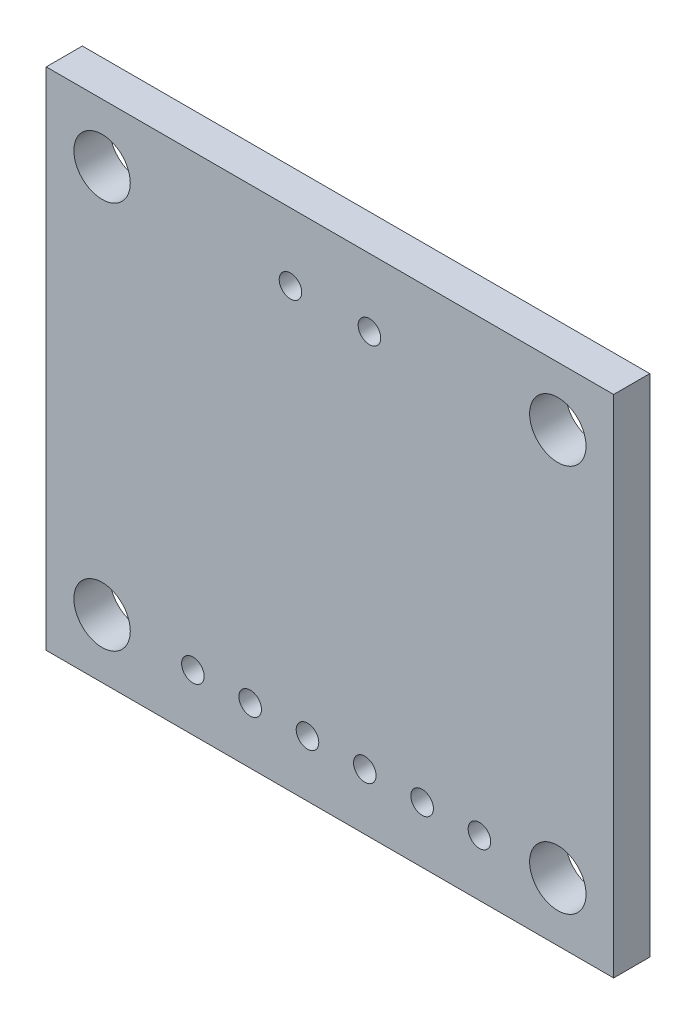
ISO-10303-21;
HEADER;
FILE_DESCRIPTION(('STEP AP214'),'2;1');
FILE_NAME('part.step','',(''),(''),'','','');
FILE_SCHEMA(('AUTOMOTIVE_DESIGN { 1 0 10303 214 1 1 1 1 }'));
ENDSEC;
DATA;
#1=APPLICATION_CONTEXT('core data for automotive mechanical design processes');
#2=APPLICATION_PROTOCOL_DEFINITION('international standard','automotive_design',2000,#1);
#3=PRODUCT_CONTEXT('',#1,'mechanical');
#4=PRODUCT('Part','Part','',(#3));
#5=PRODUCT_RELATED_PRODUCT_CATEGORY('part','',(#4));
#6=PRODUCT_DEFINITION_FORMATION('','',#4);
#7=PRODUCT_DEFINITION_CONTEXT('part definition',#1,'design');
#8=PRODUCT_DEFINITION('design','',#6,#7);
#9=PRODUCT_DEFINITION_SHAPE('','',#8);
#10=(LENGTH_UNIT() NAMED_UNIT(*) SI_UNIT(.MILLI.,.METRE.));
#11=(NAMED_UNIT(*) PLANE_ANGLE_UNIT() SI_UNIT($,.RADIAN.));
#12=(NAMED_UNIT(*) SI_UNIT($,.STERADIAN.) SOLID_ANGLE_UNIT());
#13=UNCERTAINTY_MEASURE_WITH_UNIT(LENGTH_MEASURE(1.E-05),#10,'distance_accuracy_value','');
#14=(GEOMETRIC_REPRESENTATION_CONTEXT(3) GLOBAL_UNCERTAINTY_ASSIGNED_CONTEXT((#13)) GLOBAL_UNIT_ASSIGNED_CONTEXT((#10,
#11,#12)) REPRESENTATION_CONTEXT('',''));
#15=CARTESIAN_POINT('',(0.,0.,0.));
#16=DIRECTION('',(0.,0.,1.));
#17=DIRECTION('',(1.,0.,0.));
#18=AXIS2_PLACEMENT_3D('',#15,#16,#17);
#19=CARTESIAN_POINT('',(0.,0.,1.6));
#20=DIRECTION('',(0.,0.,-1.));
#21=DIRECTION('',(-1.,0.,0.));
#22=AXIS2_PLACEMENT_3D('',#19,#20,#21);
#23=PLANE('',#22);
#24=DIRECTION('',(0.,1.,0.));
#25=VECTOR('',#24,1.);
#26=CARTESIAN_POINT('',(12.575,-11.2,1.6));
#27=LINE('',#26,#25);
#28=CARTESIAN_POINT('',(12.575,-11.2,1.6));
#29=VERTEX_POINT('',#28);
#30=CARTESIAN_POINT('',(12.575,11.2,1.6));
#31=VERTEX_POINT('',#30);
#32=EDGE_CURVE('E85',#29,#31,#27,.T.);
#33=ORIENTED_EDGE('',*,*,#32,.T.);
#34=DIRECTION('',(-1.,0.,0.));
#35=VECTOR('',#34,1.);
#36=CARTESIAN_POINT('',(-12.575,11.2,1.6));
#37=LINE('',#36,#35);
#38=CARTESIAN_POINT('',(-12.575,11.2,1.6));
#39=VERTEX_POINT('',#38);
#40=EDGE_CURVE('E80',#31,#39,#37,.T.);
#41=ORIENTED_EDGE('',*,*,#40,.T.);
#42=DIRECTION('',(0.,-1.,0.));
#43=VECTOR('',#42,1.);
#44=CARTESIAN_POINT('',(-12.575,-11.2,1.6));
#45=LINE('',#44,#43);
#46=CARTESIAN_POINT('',(-12.575,-11.2,1.6));
#47=VERTEX_POINT('',#46);
#48=EDGE_CURVE('E83',#39,#47,#45,.T.);
#49=ORIENTED_EDGE('',*,*,#48,.T.);
#50=DIRECTION('',(1.,0.,0.));
#51=VECTOR('',#50,1.);
#52=CARTESIAN_POINT('',(-12.575,-11.2,1.6));
#53=LINE('',#52,#51);
#54=EDGE_CURVE('E50',#47,#29,#53,.T.);
#55=ORIENTED_EDGE('',*,*,#54,.T.);
#56=EDGE_LOOP('',(#33,#41,#49,#55));
#57=FACE_BOUND('',#56,.T.);
#58=CARTESIAN_POINT('',(-10.1,8.6,1.6));
#59=DIRECTION('',(0.,0.,1.));
#60=DIRECTION('',(1.,0.,0.));
#61=AXIS2_PLACEMENT_3D('',#58,#59,#60);
#62=CIRCLE('',#61,1.25);
#63=CARTESIAN_POINT('',(-8.85,8.6,1.6));
#64=VERTEX_POINT('',#63);
#65=EDGE_CURVE('E100',#64,#64,#62,.T.);
#66=ORIENTED_EDGE('',*,*,#65,.F.);
#67=EDGE_LOOP('',(#66));
#68=FACE_BOUND('',#67,.T.);
#69=CARTESIAN_POINT('',(10.1,8.6,1.6));
#70=DIRECTION('',(0.,0.,1.));
#71=DIRECTION('',(1.,0.,0.));
#72=AXIS2_PLACEMENT_3D('',#69,#70,#71);
#73=CIRCLE('',#72,1.25);
#74=CARTESIAN_POINT('',(11.35,8.6,1.6));
#75=VERTEX_POINT('',#74);
#76=EDGE_CURVE('E115',#75,#75,#73,.T.);
#77=ORIENTED_EDGE('',*,*,#76,.F.);
#78=EDGE_LOOP('',(#77));
#79=FACE_BOUND('',#78,.T.);
#80=CARTESIAN_POINT('',(-10.1,-8.6,1.6));
#81=DIRECTION('',(0.,0.,1.));
#82=DIRECTION('',(1.,0.,0.));
#83=AXIS2_PLACEMENT_3D('',#80,#81,#82);
#84=CIRCLE('',#83,1.25);
#85=CARTESIAN_POINT('',(-8.85,-8.6,1.6));
#86=VERTEX_POINT('',#85);
#87=EDGE_CURVE('E121',#86,#86,#84,.T.);
#88=ORIENTED_EDGE('',*,*,#87,.F.);
#89=EDGE_LOOP('',(#88));
#90=FACE_BOUND('',#89,.T.);
#91=CARTESIAN_POINT('',(10.1,-8.6,1.6));
#92=DIRECTION('',(0.,0.,1.));
#93=DIRECTION('',(1.,0.,0.));
#94=AXIS2_PLACEMENT_3D('',#91,#92,#93);
#95=CIRCLE('',#94,1.25);
#96=CARTESIAN_POINT('',(11.35,-8.6,1.6));
#97=VERTEX_POINT('',#96);
#98=EDGE_CURVE('E127',#97,#97,#95,.T.);
#99=ORIENTED_EDGE('',*,*,#98,.F.);
#100=EDGE_LOOP('',(#99));
#101=FACE_BOUND('',#100,.T.);
#102=CARTESIAN_POINT('',(1.75,8.2,1.6));
#103=DIRECTION('',(0.,0.,1.));
#104=DIRECTION('',(1.,0.,0.));
#105=AXIS2_PLACEMENT_3D('',#102,#103,#104);
#106=CIRCLE('',#105,0.5);
#107=CARTESIAN_POINT('',(2.25,8.2,1.6));
#108=VERTEX_POINT('',#107);
#109=EDGE_CURVE('E133',#108,#108,#106,.T.);
#110=ORIENTED_EDGE('',*,*,#109,.F.);
#111=EDGE_LOOP('',(#110));
#112=FACE_BOUND('',#111,.T.);
#113=CARTESIAN_POINT('',(-1.75,8.2,1.6));
#114=DIRECTION('',(0.,0.,1.));
#115=DIRECTION('',(1.,0.,0.));
#116=AXIS2_PLACEMENT_3D('',#113,#114,#115);
#117=CIRCLE('',#116,0.5);
#118=CARTESIAN_POINT('',(-1.25,8.2,1.6));
#119=VERTEX_POINT('',#118);
#120=EDGE_CURVE('E139',#119,#119,#117,.T.);
#121=ORIENTED_EDGE('',*,*,#120,.F.);
#122=EDGE_LOOP('',(#121));
#123=FACE_BOUND('',#122,.T.);
#124=CARTESIAN_POINT('',(-6.075,-8.7,1.6));
#125=DIRECTION('',(0.,0.,1.));
#126=DIRECTION('',(1.,0.,0.));
#127=AXIS2_PLACEMENT_3D('',#124,#125,#126);
#128=CIRCLE('',#127,0.500000000000002);
#129=CARTESIAN_POINT('',(-5.575,-8.7,1.6));
#130=VERTEX_POINT('',#129);
#131=EDGE_CURVE('E145',#130,#130,#128,.T.);
#132=ORIENTED_EDGE('',*,*,#131,.F.);
#133=EDGE_LOOP('',(#132));
#134=FACE_BOUND('',#133,.T.);
#135=CARTESIAN_POINT('',(-0.995000000000003,-8.7,1.6));
#136=DIRECTION('',(0.,0.,1.));
#137=DIRECTION('',(1.,0.,0.));
#138=AXIS2_PLACEMENT_3D('',#135,#136,#137);
#139=CIRCLE('',#138,0.500000000000001);
#140=CARTESIAN_POINT('',(-0.495000000000002,-8.7,1.6));
#141=VERTEX_POINT('',#140);
#142=EDGE_CURVE('E151',#141,#141,#139,.T.);
#143=ORIENTED_EDGE('',*,*,#142,.F.);
#144=EDGE_LOOP('',(#143));
#145=FACE_BOUND('',#144,.T.);
#146=CARTESIAN_POINT('',(-3.535,-8.7,1.6));
#147=DIRECTION('',(0.,0.,1.));
#148=DIRECTION('',(1.,0.,0.));
#149=AXIS2_PLACEMENT_3D('',#146,#147,#148);
#150=CIRCLE('',#149,0.5);
#151=CARTESIAN_POINT('',(-3.035,-8.7,1.6));
#152=VERTEX_POINT('',#151);
#153=EDGE_CURVE('E157',#152,#152,#150,.T.);
#154=ORIENTED_EDGE('',*,*,#153,.F.);
#155=EDGE_LOOP('',(#154));
#156=FACE_BOUND('',#155,.T.);
#157=CARTESIAN_POINT('',(1.545,-8.7,1.6));
#158=DIRECTION('',(0.,0.,1.));
#159=DIRECTION('',(1.,0.,0.));
#160=AXIS2_PLACEMENT_3D('',#157,#158,#159);
#161=CIRCLE('',#160,0.5);
#162=CARTESIAN_POINT('',(2.045,-8.7,1.6));
#163=VERTEX_POINT('',#162);
#164=EDGE_CURVE('E163',#163,#163,#161,.T.);
#165=ORIENTED_EDGE('',*,*,#164,.F.);
#166=EDGE_LOOP('',(#165));
#167=FACE_BOUND('',#166,.T.);
#168=CARTESIAN_POINT('',(4.085,-8.7,1.6));
#169=DIRECTION('',(0.,0.,1.));
#170=DIRECTION('',(1.,0.,0.));
#171=AXIS2_PLACEMENT_3D('',#168,#169,#170);
#172=CIRCLE('',#171,0.500000000000002);
#173=CARTESIAN_POINT('',(4.585,-8.7,1.6));
#174=VERTEX_POINT('',#173);
#175=EDGE_CURVE('E169',#174,#174,#172,.T.);
#176=ORIENTED_EDGE('',*,*,#175,.F.);
#177=EDGE_LOOP('',(#176));
#178=FACE_BOUND('',#177,.T.);
#179=CARTESIAN_POINT('',(6.625,-8.7,1.6));
#180=DIRECTION('',(0.,0.,1.));
#181=DIRECTION('',(1.,0.,0.));
#182=AXIS2_PLACEMENT_3D('',#179,#180,#181);
#183=CIRCLE('',#182,0.500000000000001);
#184=CARTESIAN_POINT('',(7.125,-8.7,1.6));
#185=VERTEX_POINT('',#184);
#186=EDGE_CURVE('E175',#185,#185,#183,.T.);
#187=ORIENTED_EDGE('',*,*,#186,.F.);
#188=EDGE_LOOP('',(#187));
#189=FACE_BOUND('',#188,.T.);
#190=ADVANCED_FACE('F33',(#57,#68,#79,#90,#101,#112,#123,#134,#145,#156,#167,#178,#189),#23,.F.);
#191=CARTESIAN_POINT('',(0.,0.,0.));
#192=DIRECTION('',(0.,0.,-1.));
#193=DIRECTION('',(-1.,0.,0.));
#194=AXIS2_PLACEMENT_3D('',#191,#192,#193);
#195=PLANE('',#194);
#196=CARTESIAN_POINT('',(4.085,-8.7,0.));
#197=DIRECTION('',(0.,0.,1.));
#198=DIRECTION('',(1.,0.,0.));
#199=AXIS2_PLACEMENT_3D('',#196,#197,#198);
#200=CIRCLE('',#199,0.500000000000002);
#201=CARTESIAN_POINT('',(4.585,-8.7,0.));
#202=VERTEX_POINT('',#201);
#203=EDGE_CURVE('E172',#202,#202,#200,.T.);
#204=ORIENTED_EDGE('',*,*,#203,.T.);
#205=EDGE_LOOP('',(#204));
#206=FACE_BOUND('',#205,.T.);
#207=CARTESIAN_POINT('',(-3.535,-8.7,0.));
#208=DIRECTION('',(0.,0.,1.));
#209=DIRECTION('',(1.,0.,0.));
#210=AXIS2_PLACEMENT_3D('',#207,#208,#209);
#211=CIRCLE('',#210,0.5);
#212=CARTESIAN_POINT('',(-3.035,-8.7,0.));
#213=VERTEX_POINT('',#212);
#214=EDGE_CURVE('E160',#213,#213,#211,.T.);
#215=ORIENTED_EDGE('',*,*,#214,.T.);
#216=EDGE_LOOP('',(#215));
#217=FACE_BOUND('',#216,.T.);
#218=CARTESIAN_POINT('',(-6.075,-8.7,0.));
#219=DIRECTION('',(0.,0.,1.));
#220=DIRECTION('',(1.,0.,0.));
#221=AXIS2_PLACEMENT_3D('',#218,#219,#220);
#222=CIRCLE('',#221,0.500000000000002);
#223=CARTESIAN_POINT('',(-5.575,-8.7,0.));
#224=VERTEX_POINT('',#223);
#225=EDGE_CURVE('E148',#224,#224,#222,.T.);
#226=ORIENTED_EDGE('',*,*,#225,.T.);
#227=EDGE_LOOP('',(#226));
#228=FACE_BOUND('',#227,.T.);
#229=CARTESIAN_POINT('',(1.75,8.2,0.));
#230=DIRECTION('',(0.,0.,1.));
#231=DIRECTION('',(1.,0.,0.));
#232=AXIS2_PLACEMENT_3D('',#229,#230,#231);
#233=CIRCLE('',#232,0.5);
#234=CARTESIAN_POINT('',(2.25,8.2,0.));
#235=VERTEX_POINT('',#234);
#236=EDGE_CURVE('E136',#235,#235,#233,.T.);
#237=ORIENTED_EDGE('',*,*,#236,.T.);
#238=EDGE_LOOP('',(#237));
#239=FACE_BOUND('',#238,.T.);
#240=CARTESIAN_POINT('',(-10.1,-8.6,0.));
#241=DIRECTION('',(0.,0.,1.));
#242=DIRECTION('',(1.,0.,0.));
#243=AXIS2_PLACEMENT_3D('',#240,#241,#242);
#244=CIRCLE('',#243,1.25);
#245=CARTESIAN_POINT('',(-8.85,-8.6,0.));
#246=VERTEX_POINT('',#245);
#247=EDGE_CURVE('E124',#246,#246,#244,.T.);
#248=ORIENTED_EDGE('',*,*,#247,.T.);
#249=EDGE_LOOP('',(#248));
#250=FACE_BOUND('',#249,.T.);
#251=CARTESIAN_POINT('',(-10.1,8.6,0.));
#252=DIRECTION('',(0.,0.,1.));
#253=DIRECTION('',(1.,0.,0.));
#254=AXIS2_PLACEMENT_3D('',#251,#252,#253);
#255=CIRCLE('',#254,1.25);
#256=CARTESIAN_POINT('',(-8.85,8.6,0.));
#257=VERTEX_POINT('',#256);
#258=EDGE_CURVE('E112',#257,#257,#255,.T.);
#259=ORIENTED_EDGE('',*,*,#258,.T.);
#260=EDGE_LOOP('',(#259));
#261=FACE_BOUND('',#260,.T.);
#262=DIRECTION('',(0.,1.,0.));
#263=VECTOR('',#262,1.);
#264=CARTESIAN_POINT('',(12.575,-11.2,0.));
#265=LINE('',#264,#263);
#266=CARTESIAN_POINT('',(12.575,-11.2,0.));
#267=VERTEX_POINT('',#266);
#268=CARTESIAN_POINT('',(12.575,11.2,0.));
#269=VERTEX_POINT('',#268);
#270=EDGE_CURVE('E97',#267,#269,#265,.T.);
#271=ORIENTED_EDGE('',*,*,#270,.F.);
#272=DIRECTION('',(1.,0.,0.));
#273=VECTOR('',#272,1.);
#274=CARTESIAN_POINT('',(-12.575,-11.2,0.));
#275=LINE('',#274,#273);
#276=CARTESIAN_POINT('',(-12.575,-11.2,0.));
#277=VERTEX_POINT('',#276);
#278=EDGE_CURVE('E73',#277,#267,#275,.T.);
#279=ORIENTED_EDGE('',*,*,#278,.F.);
#280=DIRECTION('',(0.,-1.,0.));
#281=VECTOR('',#280,1.);
#282=CARTESIAN_POINT('',(-12.575,-11.2,0.));
#283=LINE('',#282,#281);
#284=CARTESIAN_POINT('',(-12.575,11.2,0.));
#285=VERTEX_POINT('',#284);
#286=EDGE_CURVE('E67',#285,#277,#283,.T.);
#287=ORIENTED_EDGE('',*,*,#286,.F.);
#288=DIRECTION('',(-1.,0.,0.));
#289=VECTOR('',#288,1.);
#290=CARTESIAN_POINT('',(-12.575,11.2,0.));
#291=LINE('',#290,#289);
#292=EDGE_CURVE('E89',#269,#285,#291,.T.);
#293=ORIENTED_EDGE('',*,*,#292,.F.);
#294=EDGE_LOOP('',(#271,#279,#287,#293));
#295=FACE_BOUND('',#294,.T.);
#296=CARTESIAN_POINT('',(10.1,8.6,0.));
#297=DIRECTION('',(0.,0.,1.));
#298=DIRECTION('',(1.,0.,0.));
#299=AXIS2_PLACEMENT_3D('',#296,#297,#298);
#300=CIRCLE('',#299,1.25);
#301=CARTESIAN_POINT('',(11.35,8.6,0.));
#302=VERTEX_POINT('',#301);
#303=EDGE_CURVE('E118',#302,#302,#300,.T.);
#304=ORIENTED_EDGE('',*,*,#303,.T.);
#305=EDGE_LOOP('',(#304));
#306=FACE_BOUND('',#305,.T.);
#307=CARTESIAN_POINT('',(10.1,-8.6,0.));
#308=DIRECTION('',(0.,0.,1.));
#309=DIRECTION('',(1.,0.,0.));
#310=AXIS2_PLACEMENT_3D('',#307,#308,#309);
#311=CIRCLE('',#310,1.25);
#312=CARTESIAN_POINT('',(11.35,-8.6,0.));
#313=VERTEX_POINT('',#312);
#314=EDGE_CURVE('E130',#313,#313,#311,.T.);
#315=ORIENTED_EDGE('',*,*,#314,.T.);
#316=EDGE_LOOP('',(#315));
#317=FACE_BOUND('',#316,.T.);
#318=CARTESIAN_POINT('',(-1.75,8.2,0.));
#319=DIRECTION('',(0.,0.,1.));
#320=DIRECTION('',(1.,0.,0.));
#321=AXIS2_PLACEMENT_3D('',#318,#319,#320);
#322=CIRCLE('',#321,0.5);
#323=CARTESIAN_POINT('',(-1.25,8.2,0.));
#324=VERTEX_POINT('',#323);
#325=EDGE_CURVE('E142',#324,#324,#322,.T.);
#326=ORIENTED_EDGE('',*,*,#325,.T.);
#327=EDGE_LOOP('',(#326));
#328=FACE_BOUND('',#327,.T.);
#329=CARTESIAN_POINT('',(-0.995000000000003,-8.7,0.));
#330=DIRECTION('',(0.,0.,1.));
#331=DIRECTION('',(1.,0.,0.));
#332=AXIS2_PLACEMENT_3D('',#329,#330,#331);
#333=CIRCLE('',#332,0.500000000000001);
#334=CARTESIAN_POINT('',(-0.495000000000002,-8.7,0.));
#335=VERTEX_POINT('',#334);
#336=EDGE_CURVE('E154',#335,#335,#333,.T.);
#337=ORIENTED_EDGE('',*,*,#336,.T.);
#338=EDGE_LOOP('',(#337));
#339=FACE_BOUND('',#338,.T.);
#340=CARTESIAN_POINT('',(1.545,-8.7,0.));
#341=DIRECTION('',(0.,0.,1.));
#342=DIRECTION('',(1.,0.,0.));
#343=AXIS2_PLACEMENT_3D('',#340,#341,#342);
#344=CIRCLE('',#343,0.5);
#345=CARTESIAN_POINT('',(2.045,-8.7,0.));
#346=VERTEX_POINT('',#345);
#347=EDGE_CURVE('E166',#346,#346,#344,.T.);
#348=ORIENTED_EDGE('',*,*,#347,.T.);
#349=EDGE_LOOP('',(#348));
#350=FACE_BOUND('',#349,.T.);
#351=CARTESIAN_POINT('',(6.625,-8.7,0.));
#352=DIRECTION('',(0.,0.,1.));
#353=DIRECTION('',(1.,0.,0.));
#354=AXIS2_PLACEMENT_3D('',#351,#352,#353);
#355=CIRCLE('',#354,0.500000000000001);
#356=CARTESIAN_POINT('',(7.125,-8.7,0.));
#357=VERTEX_POINT('',#356);
#358=EDGE_CURVE('E178',#357,#357,#355,.T.);
#359=ORIENTED_EDGE('',*,*,#358,.T.);
#360=EDGE_LOOP('',(#359));
#361=FACE_BOUND('',#360,.T.);
#362=ADVANCED_FACE('F108',(#206,#217,#228,#239,#250,#261,#295,#306,#317,#328,#339,#350,#361),
#195,.T.);
#363=CARTESIAN_POINT('',(12.575,-11.2,1.6));
#364=DIRECTION('',(-1.,0.,0.));
#365=DIRECTION('',(0.,0.,1.));
#366=AXIS2_PLACEMENT_3D('',#363,#364,#365);
#367=PLANE('',#366);
#368=ORIENTED_EDGE('',*,*,#270,.T.);
#369=DIRECTION('',(0.,0.,-1.));
#370=VECTOR('',#369,1.);
#371=CARTESIAN_POINT('',(12.575,11.2,1.6));
#372=LINE('',#371,#370);
#373=EDGE_CURVE('E11',#31,#269,#372,.T.);
#374=ORIENTED_EDGE('',*,*,#373,.F.);
#375=ORIENTED_EDGE('',*,*,#32,.F.);
#376=DIRECTION('',(0.,0.,-1.));
#377=VECTOR('',#376,1.);
#378=CARTESIAN_POINT('',(12.575,-11.2,1.6));
#379=LINE('',#378,#377);
#380=EDGE_CURVE('E93',#29,#267,#379,.T.);
#381=ORIENTED_EDGE('',*,*,#380,.T.);
#382=EDGE_LOOP('',(#368,#374,#375,#381));
#383=FACE_BOUND('',#382,.T.);
#384=ADVANCED_FACE('F35',(#383),#367,.F.);
#385=CARTESIAN_POINT('',(-12.575,11.2,1.6));
#386=DIRECTION('',(0.,-1.,0.));
#387=DIRECTION('',(0.,0.,-1.));
#388=AXIS2_PLACEMENT_3D('',#385,#386,#387);
#389=PLANE('',#388);
#390=ORIENTED_EDGE('',*,*,#292,.T.);
#391=DIRECTION('',(0.,0.,-1.));
#392=VECTOR('',#391,1.);
#393=CARTESIAN_POINT('',(-12.575,11.2,1.6));
#394=LINE('',#393,#392);
#395=EDGE_CURVE('E42',#39,#285,#394,.T.);
#396=ORIENTED_EDGE('',*,*,#395,.F.);
#397=ORIENTED_EDGE('',*,*,#40,.F.);
#398=ORIENTED_EDGE('',*,*,#373,.T.);
#399=EDGE_LOOP('',(#390,#396,#397,#398));
#400=FACE_BOUND('',#399,.T.);
#401=ADVANCED_FACE('F88',(#400),#389,.F.);
#402=CARTESIAN_POINT('',(-12.575,-11.2,1.6));
#403=DIRECTION('',(1.,0.,0.));
#404=DIRECTION('',(0.,0.,-1.));
#405=AXIS2_PLACEMENT_3D('',#402,#403,#404);
#406=PLANE('',#405);
#407=ORIENTED_EDGE('',*,*,#286,.T.);
#408=DIRECTION('',(0.,0.,-1.));
#409=VECTOR('',#408,1.);
#410=CARTESIAN_POINT('',(-12.575,-11.2,1.6));
#411=LINE('',#410,#409);
#412=EDGE_CURVE('E90',#47,#277,#411,.T.);
#413=ORIENTED_EDGE('',*,*,#412,.F.);
#414=ORIENTED_EDGE('',*,*,#48,.F.);
#415=ORIENTED_EDGE('',*,*,#395,.T.);
#416=EDGE_LOOP('',(#407,#413,#414,#415));
#417=FACE_BOUND('',#416,.T.);
#418=ADVANCED_FACE('F91',(#417),#406,.F.);
#419=CARTESIAN_POINT('',(-12.575,-11.2,1.6));
#420=DIRECTION('',(0.,1.,0.));
#421=DIRECTION('',(0.,0.,1.));
#422=AXIS2_PLACEMENT_3D('',#419,#420,#421);
#423=PLANE('',#422);
#424=ORIENTED_EDGE('',*,*,#278,.T.);
#425=ORIENTED_EDGE('',*,*,#380,.F.);
#426=ORIENTED_EDGE('',*,*,#54,.F.);
#427=ORIENTED_EDGE('',*,*,#412,.T.);
#428=EDGE_LOOP('',(#424,#425,#426,#427));
#429=FACE_BOUND('',#428,.T.);
#430=ADVANCED_FACE('F105',(#429),#423,.F.);
#431=CARTESIAN_POINT('',(-10.1,8.6,1.6));
#432=DIRECTION('',(0.,0.,-1.));
#433=DIRECTION('',(-1.,0.,0.));
#434=AXIS2_PLACEMENT_3D('',#431,#432,#433);
#435=CYLINDRICAL_SURFACE('',#434,1.25);
#436=ORIENTED_EDGE('',*,*,#65,.T.);
#437=EDGE_LOOP('',(#436));
#438=FACE_BOUND('',#437,.T.);
#439=ORIENTED_EDGE('',*,*,#258,.F.);
#440=EDGE_LOOP('',(#439));
#441=FACE_BOUND('',#440,.T.);
#442=ADVANCED_FACE('F195',(#438,#441),#435,.F.);
#443=CARTESIAN_POINT('',(10.1,8.6,1.6));
#444=DIRECTION('',(0.,0.,-1.));
#445=DIRECTION('',(-1.,0.,0.));
#446=AXIS2_PLACEMENT_3D('',#443,#444,#445);
#447=CYLINDRICAL_SURFACE('',#446,1.25);
#448=ORIENTED_EDGE('',*,*,#76,.T.);
#449=EDGE_LOOP('',(#448));
#450=FACE_BOUND('',#449,.T.);
#451=ORIENTED_EDGE('',*,*,#303,.F.);
#452=EDGE_LOOP('',(#451));
#453=FACE_BOUND('',#452,.T.);
#454=ADVANCED_FACE('F241',(#450,#453),#447,.F.);
#455=CARTESIAN_POINT('',(-10.1,-8.6,1.6));
#456=DIRECTION('',(0.,0.,-1.));
#457=DIRECTION('',(-1.,0.,0.));
#458=AXIS2_PLACEMENT_3D('',#455,#456,#457);
#459=CYLINDRICAL_SURFACE('',#458,1.25);
#460=ORIENTED_EDGE('',*,*,#87,.T.);
#461=EDGE_LOOP('',(#460));
#462=FACE_BOUND('',#461,.T.);
#463=ORIENTED_EDGE('',*,*,#247,.F.);
#464=EDGE_LOOP('',(#463));
#465=FACE_BOUND('',#464,.T.);
#466=ADVANCED_FACE('F249',(#462,#465),#459,.F.);
#467=CARTESIAN_POINT('',(10.1,-8.6,1.6));
#468=DIRECTION('',(0.,0.,-1.));
#469=DIRECTION('',(-1.,0.,0.));
#470=AXIS2_PLACEMENT_3D('',#467,#468,#469);
#471=CYLINDRICAL_SURFACE('',#470,1.25);
#472=ORIENTED_EDGE('',*,*,#98,.T.);
#473=EDGE_LOOP('',(#472));
#474=FACE_BOUND('',#473,.T.);
#475=ORIENTED_EDGE('',*,*,#314,.F.);
#476=EDGE_LOOP('',(#475));
#477=FACE_BOUND('',#476,.T.);
#478=ADVANCED_FACE('F257',(#474,#477),#471,.F.);
#479=CARTESIAN_POINT('',(1.75,8.2,1.6));
#480=DIRECTION('',(0.,0.,-1.));
#481=DIRECTION('',(-1.,0.,0.));
#482=AXIS2_PLACEMENT_3D('',#479,#480,#481);
#483=CYLINDRICAL_SURFACE('',#482,0.5);
#484=ORIENTED_EDGE('',*,*,#109,.T.);
#485=EDGE_LOOP('',(#484));
#486=FACE_BOUND('',#485,.T.);
#487=ORIENTED_EDGE('',*,*,#236,.F.);
#488=EDGE_LOOP('',(#487));
#489=FACE_BOUND('',#488,.T.);
#490=ADVANCED_FACE('F266',(#486,#489),#483,.F.);
#491=CARTESIAN_POINT('',(-1.75,8.2,1.6));
#492=DIRECTION('',(0.,0.,-1.));
#493=DIRECTION('',(-1.,0.,0.));
#494=AXIS2_PLACEMENT_3D('',#491,#492,#493);
#495=CYLINDRICAL_SURFACE('',#494,0.5);
#496=ORIENTED_EDGE('',*,*,#120,.T.);
#497=EDGE_LOOP('',(#496));
#498=FACE_BOUND('',#497,.T.);
#499=ORIENTED_EDGE('',*,*,#325,.F.);
#500=EDGE_LOOP('',(#499));
#501=FACE_BOUND('',#500,.T.);
#502=ADVANCED_FACE('F275',(#498,#501),#495,.F.);
#503=CARTESIAN_POINT('',(-6.075,-8.7,1.6));
#504=DIRECTION('',(0.,0.,-1.));
#505=DIRECTION('',(-1.,0.,0.));
#506=AXIS2_PLACEMENT_3D('',#503,#504,#505);
#507=CYLINDRICAL_SURFACE('',#506,0.500000000000002);
#508=ORIENTED_EDGE('',*,*,#131,.T.);
#509=EDGE_LOOP('',(#508));
#510=FACE_BOUND('',#509,.T.);
#511=ORIENTED_EDGE('',*,*,#225,.F.);
#512=EDGE_LOOP('',(#511));
#513=FACE_BOUND('',#512,.T.);
#514=ADVANCED_FACE('F284',(#510,#513),#507,.F.);
#515=CARTESIAN_POINT('',(-0.995000000000003,-8.7,1.6));
#516=DIRECTION('',(0.,0.,-1.));
#517=DIRECTION('',(-1.,0.,0.));
#518=AXIS2_PLACEMENT_3D('',#515,#516,#517);
#519=CYLINDRICAL_SURFACE('',#518,0.500000000000001);
#520=ORIENTED_EDGE('',*,*,#142,.T.);
#521=EDGE_LOOP('',(#520));
#522=FACE_BOUND('',#521,.T.);
#523=ORIENTED_EDGE('',*,*,#336,.F.);
#524=EDGE_LOOP('',(#523));
#525=FACE_BOUND('',#524,.T.);
#526=ADVANCED_FACE('F293',(#522,#525),#519,.F.);
#527=CARTESIAN_POINT('',(-3.535,-8.7,1.6));
#528=DIRECTION('',(0.,0.,-1.));
#529=DIRECTION('',(-1.,0.,0.));
#530=AXIS2_PLACEMENT_3D('',#527,#528,#529);
#531=CYLINDRICAL_SURFACE('',#530,0.5);
#532=ORIENTED_EDGE('',*,*,#153,.T.);
#533=EDGE_LOOP('',(#532));
#534=FACE_BOUND('',#533,.T.);
#535=ORIENTED_EDGE('',*,*,#214,.F.);
#536=EDGE_LOOP('',(#535));
#537=FACE_BOUND('',#536,.T.);
#538=ADVANCED_FACE('F302',(#534,#537),#531,.F.);
#539=CARTESIAN_POINT('',(1.545,-8.7,1.6));
#540=DIRECTION('',(0.,0.,-1.));
#541=DIRECTION('',(-1.,0.,0.));
#542=AXIS2_PLACEMENT_3D('',#539,#540,#541);
#543=CYLINDRICAL_SURFACE('',#542,0.5);
#544=ORIENTED_EDGE('',*,*,#164,.T.);
#545=EDGE_LOOP('',(#544));
#546=FACE_BOUND('',#545,.T.);
#547=ORIENTED_EDGE('',*,*,#347,.F.);
#548=EDGE_LOOP('',(#547));
#549=FACE_BOUND('',#548,.T.);
#550=ADVANCED_FACE('F311',(#546,#549),#543,.F.);
#551=CARTESIAN_POINT('',(4.085,-8.7,1.6));
#552=DIRECTION('',(0.,0.,-1.));
#553=DIRECTION('',(-1.,0.,0.));
#554=AXIS2_PLACEMENT_3D('',#551,#552,#553);
#555=CYLINDRICAL_SURFACE('',#554,0.500000000000002);
#556=ORIENTED_EDGE('',*,*,#175,.T.);
#557=EDGE_LOOP('',(#556));
#558=FACE_BOUND('',#557,.T.);
#559=ORIENTED_EDGE('',*,*,#203,.F.);
#560=EDGE_LOOP('',(#559));
#561=FACE_BOUND('',#560,.T.);
#562=ADVANCED_FACE('F320',(#558,#561),#555,.F.);
#563=CARTESIAN_POINT('',(6.625,-8.7,1.6));
#564=DIRECTION('',(0.,0.,-1.));
#565=DIRECTION('',(-1.,0.,0.));
#566=AXIS2_PLACEMENT_3D('',#563,#564,#565);
#567=CYLINDRICAL_SURFACE('',#566,0.500000000000001);
#568=ORIENTED_EDGE('',*,*,#186,.T.);
#569=EDGE_LOOP('',(#568));
#570=FACE_BOUND('',#569,.T.);
#571=ORIENTED_EDGE('',*,*,#358,.F.);
#572=EDGE_LOOP('',(#571));
#573=FACE_BOUND('',#572,.T.);
#574=ADVANCED_FACE('F184',(#570,#573),#567,.F.);
#575=CLOSED_SHELL('',(#190,#362,#384,#401,#418,#430,#442,#454,#466,#478,#490,#502,#514,#526,
#538,#550,#562,#574));
#576=MANIFOLD_SOLID_BREP('B2',#575);
#577=ADVANCED_BREP_SHAPE_REPRESENTATION('',(#18,#576),#14);
#578=SHAPE_DEFINITION_REPRESENTATION(#9,#577);
ENDSEC;
END-ISO-10303-21;
